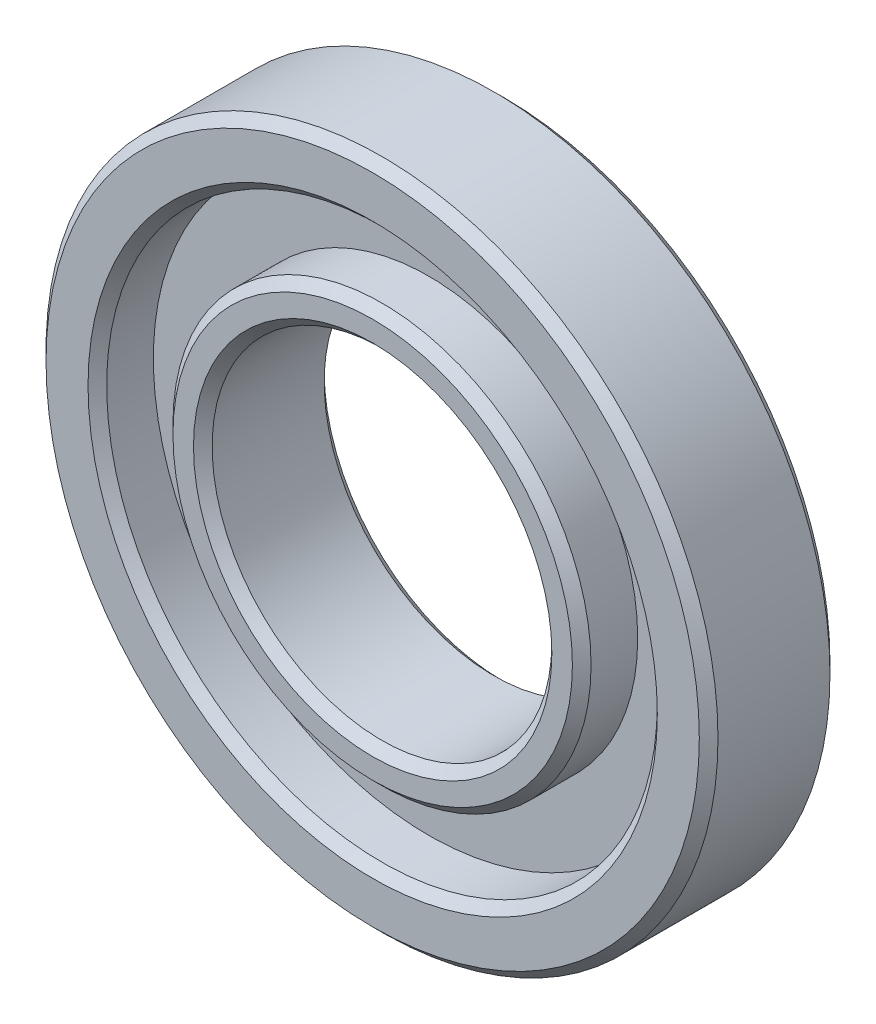
ISO-10303-21;
HEADER;
FILE_DESCRIPTION(('STEP AP214'),'2;1');
FILE_NAME('part.step','',(''),(''),'','','');
FILE_SCHEMA(('AUTOMOTIVE_DESIGN { 1 0 10303 214 1 1 1 1 }'));
ENDSEC;
DATA;
#1=APPLICATION_CONTEXT('core data for automotive mechanical design processes');
#2=APPLICATION_PROTOCOL_DEFINITION('international standard','automotive_design',2000,#1);
#3=PRODUCT_CONTEXT('',#1,'mechanical');
#4=PRODUCT('Part','Part','',(#3));
#5=PRODUCT_RELATED_PRODUCT_CATEGORY('part','',(#4));
#6=PRODUCT_DEFINITION_FORMATION('','',#4);
#7=PRODUCT_DEFINITION_CONTEXT('part definition',#1,'design');
#8=PRODUCT_DEFINITION('design','',#6,#7);
#9=PRODUCT_DEFINITION_SHAPE('','',#8);
#10=(LENGTH_UNIT() NAMED_UNIT(*) SI_UNIT(.MILLI.,.METRE.));
#11=(NAMED_UNIT(*) PLANE_ANGLE_UNIT() SI_UNIT($,.RADIAN.));
#12=(NAMED_UNIT(*) SI_UNIT($,.STERADIAN.) SOLID_ANGLE_UNIT());
#13=UNCERTAINTY_MEASURE_WITH_UNIT(LENGTH_MEASURE(1.E-05),#10,'distance_accuracy_value','');
#14=(GEOMETRIC_REPRESENTATION_CONTEXT(3) GLOBAL_UNCERTAINTY_ASSIGNED_CONTEXT((#13)) GLOBAL_UNIT_ASSIGNED_CONTEXT((#10,
#11,#12)) REPRESENTATION_CONTEXT('',''));
#15=CARTESIAN_POINT('',(0.,0.,0.));
#16=DIRECTION('',(0.,0.,1.));
#17=DIRECTION('',(1.,0.,0.));
#18=AXIS2_PLACEMENT_3D('',#15,#16,#17);
#19=CARTESIAN_POINT('',(0.,0.,7.));
#20=DIRECTION('',(0.,0.,1.));
#21=DIRECTION('',(1.,0.,0.));
#22=AXIS2_PLACEMENT_3D('',#19,#20,#21);
#23=PLANE('',#22);
#24=CARTESIAN_POINT('',(0.,0.,7.));
#25=DIRECTION('',(0.,0.,1.));
#26=DIRECTION('',(1.,0.,0.));
#27=AXIS2_PLACEMENT_3D('',#24,#25,#26);
#28=CIRCLE('',#27,9.59999999999999);
#29=CARTESIAN_POINT('',(9.59999999999999,0.,7.));
#30=VERTEX_POINT('',#29);
#31=EDGE_CURVE('E50',#30,#30,#28,.F.);
#32=ORIENTED_EDGE('',*,*,#31,.T.);
#33=EDGE_LOOP('',(#32));
#34=FACE_BOUND('',#33,.T.);
#35=CARTESIAN_POINT('',(0.,0.,7.));
#36=DIRECTION('',(0.,0.,1.));
#37=DIRECTION('',(1.,0.,0.));
#38=AXIS2_PLACEMENT_3D('',#35,#36,#37);
#39=CIRCLE('',#38,10.7);
#40=CARTESIAN_POINT('',(10.7,0.,7.));
#41=VERTEX_POINT('',#40);
#42=EDGE_CURVE('E53',#41,#41,#39,.T.);
#43=ORIENTED_EDGE('',*,*,#42,.T.);
#44=EDGE_LOOP('',(#43));
#45=FACE_BOUND('',#44,.T.);
#46=ADVANCED_FACE('F30',(#34,#45),#23,.T.);
#47=CARTESIAN_POINT('',(0.,0.,7.));
#48=DIRECTION('',(0.,0.,1.));
#49=DIRECTION('',(1.,0.,0.));
#50=AXIS2_PLACEMENT_3D('',#47,#48,#49);
#51=CIRCLE('',#50,15.25);
#52=CARTESIAN_POINT('',(15.25,0.,7.));
#53=VERTEX_POINT('',#52);
#54=EDGE_CURVE('E10',#53,#53,#51,.F.);
#55=ORIENTED_EDGE('',*,*,#54,.T.);
#56=EDGE_LOOP('',(#55));
#57=FACE_BOUND('',#56,.T.);
#58=CARTESIAN_POINT('',(0.,0.,7.));
#59=DIRECTION('',(0.,0.,1.));
#60=DIRECTION('',(1.,0.,0.));
#61=AXIS2_PLACEMENT_3D('',#58,#59,#60);
#62=CIRCLE('',#61,17.5);
#63=CARTESIAN_POINT('',(17.5,0.,7.));
#64=VERTEX_POINT('',#63);
#65=EDGE_CURVE('E37',#64,#64,#62,.T.);
#66=ORIENTED_EDGE('',*,*,#65,.T.);
#67=EDGE_LOOP('',(#66));
#68=FACE_BOUND('',#67,.T.);
#69=ADVANCED_FACE('F101',(#57,#68),#23,.T.);
#70=CARTESIAN_POINT('',(0.,0.,0.));
#71=DIRECTION('',(0.,0.,1.));
#72=DIRECTION('',(1.,0.,0.));
#73=AXIS2_PLACEMENT_3D('',#70,#71,#72);
#74=PLANE('',#73);
#75=CARTESIAN_POINT('',(0.,0.,0.));
#76=DIRECTION('',(0.,0.,1.));
#77=DIRECTION('',(1.,0.,0.));
#78=AXIS2_PLACEMENT_3D('',#75,#76,#77);
#79=CIRCLE('',#78,9.60000000000001);
#80=CARTESIAN_POINT('',(9.60000000000001,0.,0.));
#81=VERTEX_POINT('',#80);
#82=EDGE_CURVE('E68',#81,#81,#79,.T.);
#83=ORIENTED_EDGE('',*,*,#82,.T.);
#84=EDGE_LOOP('',(#83));
#85=FACE_BOUND('',#84,.T.);
#86=CARTESIAN_POINT('',(0.,0.,0.));
#87=DIRECTION('',(0.,0.,1.));
#88=DIRECTION('',(1.,0.,0.));
#89=AXIS2_PLACEMENT_3D('',#86,#87,#88);
#90=CIRCLE('',#89,17.5);
#91=CARTESIAN_POINT('',(17.5,0.,0.));
#92=VERTEX_POINT('',#91);
#93=EDGE_CURVE('E71',#92,#92,#90,.F.);
#94=ORIENTED_EDGE('',*,*,#93,.T.);
#95=EDGE_LOOP('',(#94));
#96=FACE_BOUND('',#95,.T.);
#97=ADVANCED_FACE('F107',(#85,#96),#74,.F.);
#98=CARTESIAN_POINT('',(0.,0.,7.));
#99=DIRECTION('',(0.,0.,-1.));
#100=DIRECTION('',(-1.,0.,0.));
#101=AXIS2_PLACEMENT_3D('',#98,#99,#100);
#102=CYLINDRICAL_SURFACE('',#101,18.);
#103=CARTESIAN_POINT('',(0.,0.,0.499999999999994));
#104=DIRECTION('',(0.,0.,1.));
#105=DIRECTION('',(1.,0.,0.));
#106=AXIS2_PLACEMENT_3D('',#103,#104,#105);
#107=CIRCLE('',#106,18.);
#108=CARTESIAN_POINT('',(18.,0.,0.499999999999994));
#109=VERTEX_POINT('',#108);
#110=EDGE_CURVE('E56',#109,#109,#107,.T.);
#111=ORIENTED_EDGE('',*,*,#110,.T.);
#112=EDGE_LOOP('',(#111));
#113=FACE_BOUND('',#112,.T.);
#114=CARTESIAN_POINT('',(0.,0.,6.5));
#115=DIRECTION('',(0.,0.,1.));
#116=DIRECTION('',(1.,0.,0.));
#117=AXIS2_PLACEMENT_3D('',#114,#115,#116);
#118=CIRCLE('',#117,18.);
#119=CARTESIAN_POINT('',(18.,0.,6.5));
#120=VERTEX_POINT('',#119);
#121=EDGE_CURVE('E59',#120,#120,#118,.F.);
#122=ORIENTED_EDGE('',*,*,#121,.T.);
#123=EDGE_LOOP('',(#122));
#124=FACE_BOUND('',#123,.T.);
#125=ADVANCED_FACE('F97',(#113,#124),#102,.T.);
#126=CARTESIAN_POINT('',(0.,0.,7.));
#127=DIRECTION('',(0.,0.,-1.));
#128=DIRECTION('',(-1.,0.,0.));
#129=AXIS2_PLACEMENT_3D('',#126,#127,#128);
#130=CYLINDRICAL_SURFACE('',#129,9.1);
#131=CARTESIAN_POINT('',(0.,0.,0.500000000000007));
#132=DIRECTION('',(0.,0.,1.));
#133=DIRECTION('',(1.,0.,0.));
#134=AXIS2_PLACEMENT_3D('',#131,#132,#133);
#135=CIRCLE('',#134,9.1);
#136=CARTESIAN_POINT('',(9.1,0.,0.500000000000007));
#137=VERTEX_POINT('',#136);
#138=EDGE_CURVE('E62',#137,#137,#135,.F.);
#139=ORIENTED_EDGE('',*,*,#138,.T.);
#140=EDGE_LOOP('',(#139));
#141=FACE_BOUND('',#140,.T.);
#142=CARTESIAN_POINT('',(0.,0.,6.50000000000001));
#143=DIRECTION('',(0.,0.,1.));
#144=DIRECTION('',(1.,0.,0.));
#145=AXIS2_PLACEMENT_3D('',#142,#143,#144);
#146=CIRCLE('',#145,9.1);
#147=CARTESIAN_POINT('',(9.1,0.,6.50000000000001));
#148=VERTEX_POINT('',#147);
#149=EDGE_CURVE('E65',#148,#148,#146,.T.);
#150=ORIENTED_EDGE('',*,*,#149,.T.);
#151=EDGE_LOOP('',(#150));
#152=FACE_BOUND('',#151,.T.);
#153=ADVANCED_FACE('F91',(#141,#152),#130,.F.);
#154=CARTESIAN_POINT('',(0.,0.,4.));
#155=DIRECTION('',(0.,0.,1.));
#156=DIRECTION('',(1.,0.,0.));
#157=AXIS2_PLACEMENT_3D('',#154,#155,#156);
#158=CYLINDRICAL_SURFACE('',#157,14.75);
#159=CARTESIAN_POINT('',(0.,0.,6.50000000000002));
#160=DIRECTION('',(0.,0.,1.));
#161=DIRECTION('',(1.,0.,0.));
#162=AXIS2_PLACEMENT_3D('',#159,#160,#161);
#163=CIRCLE('',#162,14.75);
#164=CARTESIAN_POINT('',(14.75,0.,6.50000000000002));
#165=VERTEX_POINT('',#164);
#166=EDGE_CURVE('E41',#165,#165,#163,.T.);
#167=ORIENTED_EDGE('',*,*,#166,.T.);
#168=EDGE_LOOP('',(#167));
#169=FACE_BOUND('',#168,.T.);
#170=CARTESIAN_POINT('',(0.,0.,4.));
#171=DIRECTION('',(0.,0.,1.));
#172=DIRECTION('',(1.,0.,0.));
#173=AXIS2_PLACEMENT_3D('',#170,#171,#172);
#174=CIRCLE('',#173,14.75);
#175=CARTESIAN_POINT('',(14.75,0.,4.));
#176=VERTEX_POINT('',#175);
#177=EDGE_CURVE('E74',#176,#176,#174,.T.);
#178=ORIENTED_EDGE('',*,*,#177,.F.);
#179=EDGE_LOOP('',(#178));
#180=FACE_BOUND('',#179,.T.);
#181=ADVANCED_FACE('F86',(#169,#180),#158,.F.);
#182=CARTESIAN_POINT('',(0.,0.,4.));
#183=DIRECTION('',(0.,0.,1.));
#184=DIRECTION('',(1.,0.,0.));
#185=AXIS2_PLACEMENT_3D('',#182,#183,#184);
#186=PLANE('',#185);
#187=CARTESIAN_POINT('',(0.,0.,4.));
#188=DIRECTION('',(0.,0.,1.));
#189=DIRECTION('',(1.,0.,0.));
#190=AXIS2_PLACEMENT_3D('',#187,#188,#189);
#191=CIRCLE('',#190,11.2);
#192=CARTESIAN_POINT('',(11.2,0.,4.));
#193=VERTEX_POINT('',#192);
#194=EDGE_CURVE('E77',#193,#193,#191,.T.);
#195=ORIENTED_EDGE('',*,*,#194,.F.);
#196=EDGE_LOOP('',(#195));
#197=FACE_BOUND('',#196,.T.);
#198=ORIENTED_EDGE('',*,*,#177,.T.);
#199=EDGE_LOOP('',(#198));
#200=FACE_BOUND('',#199,.T.);
#201=ADVANCED_FACE('F83',(#197,#200),#186,.T.);
#202=CARTESIAN_POINT('',(0.,0.,4.));
#203=DIRECTION('',(0.,0.,1.));
#204=DIRECTION('',(1.,0.,0.));
#205=AXIS2_PLACEMENT_3D('',#202,#203,#204);
#206=CYLINDRICAL_SURFACE('',#205,11.2);
#207=CARTESIAN_POINT('',(0.,0.,6.50000000000001));
#208=DIRECTION('',(0.,0.,1.));
#209=DIRECTION('',(1.,0.,0.));
#210=AXIS2_PLACEMENT_3D('',#207,#208,#209);
#211=CIRCLE('',#210,11.2);
#212=CARTESIAN_POINT('',(11.2,0.,6.50000000000001));
#213=VERTEX_POINT('',#212);
#214=EDGE_CURVE('E45',#213,#213,#211,.F.);
#215=ORIENTED_EDGE('',*,*,#214,.T.);
#216=EDGE_LOOP('',(#215));
#217=FACE_BOUND('',#216,.T.);
#218=ORIENTED_EDGE('',*,*,#194,.T.);
#219=EDGE_LOOP('',(#218));
#220=FACE_BOUND('',#219,.T.);
#221=ADVANCED_FACE('F81',(#217,#220),#206,.T.);
#222=CARTESIAN_POINT('',(0.,0.,0.));
#223=DIRECTION('',(0.,0.,-1.));
#224=DIRECTION('',(-1.,0.,0.));
#225=AXIS2_PLACEMENT_3D('',#222,#223,#224);
#226=CONICAL_SURFACE('',#225,9.60000000000001,0.785398163397452);
#227=ORIENTED_EDGE('',*,*,#138,.F.);
#228=EDGE_LOOP('',(#227));
#229=FACE_BOUND('',#228,.T.);
#230=ORIENTED_EDGE('',*,*,#82,.F.);
#231=EDGE_LOOP('',(#230));
#232=FACE_BOUND('',#231,.T.);
#233=ADVANCED_FACE('F116',(#229,#232),#226,.F.);
#234=CARTESIAN_POINT('',(0.,0.,0.499999999999994));
#235=DIRECTION('',(0.,0.,1.));
#236=DIRECTION('',(1.,0.,0.));
#237=AXIS2_PLACEMENT_3D('',#234,#235,#236);
#238=CONICAL_SURFACE('',#237,18.,0.785398163397452);
#239=ORIENTED_EDGE('',*,*,#93,.F.);
#240=EDGE_LOOP('',(#239));
#241=FACE_BOUND('',#240,.T.);
#242=ORIENTED_EDGE('',*,*,#110,.F.);
#243=EDGE_LOOP('',(#242));
#244=FACE_BOUND('',#243,.T.);
#245=ADVANCED_FACE('F119',(#241,#244),#238,.T.);
#246=CARTESIAN_POINT('',(0.,0.,6.50000000000001));
#247=DIRECTION('',(0.,0.,1.));
#248=DIRECTION('',(1.,0.,0.));
#249=AXIS2_PLACEMENT_3D('',#246,#247,#248);
#250=CONICAL_SURFACE('',#249,9.1,0.785398163397452);
#251=ORIENTED_EDGE('',*,*,#31,.F.);
#252=EDGE_LOOP('',(#251));
#253=FACE_BOUND('',#252,.T.);
#254=ORIENTED_EDGE('',*,*,#149,.F.);
#255=EDGE_LOOP('',(#254));
#256=FACE_BOUND('',#255,.T.);
#257=ADVANCED_FACE('F123',(#253,#256),#250,.F.);
#258=CARTESIAN_POINT('',(0.,0.,7.));
#259=DIRECTION('',(0.,0.,-1.));
#260=DIRECTION('',(-1.,0.,0.));
#261=AXIS2_PLACEMENT_3D('',#258,#259,#260);
#262=CONICAL_SURFACE('',#261,10.7,0.785398163397445);
#263=ORIENTED_EDGE('',*,*,#214,.F.);
#264=EDGE_LOOP('',(#263));
#265=FACE_BOUND('',#264,.T.);
#266=ORIENTED_EDGE('',*,*,#42,.F.);
#267=EDGE_LOOP('',(#266));
#268=FACE_BOUND('',#267,.T.);
#269=ADVANCED_FACE('F127',(#265,#268),#262,.T.);
#270=CARTESIAN_POINT('',(0.,0.,6.50000000000002));
#271=DIRECTION('',(0.,0.,1.));
#272=DIRECTION('',(1.,0.,0.));
#273=AXIS2_PLACEMENT_3D('',#270,#271,#272);
#274=CONICAL_SURFACE('',#273,14.75,0.78539816339745);
#275=ORIENTED_EDGE('',*,*,#54,.F.);
#276=EDGE_LOOP('',(#275));
#277=FACE_BOUND('',#276,.T.);
#278=ORIENTED_EDGE('',*,*,#166,.F.);
#279=EDGE_LOOP('',(#278));
#280=FACE_BOUND('',#279,.T.);
#281=ADVANCED_FACE('F130',(#277,#280),#274,.F.);
#282=CARTESIAN_POINT('',(0.,0.,7.));
#283=DIRECTION('',(0.,0.,-1.));
#284=DIRECTION('',(-1.,0.,0.));
#285=AXIS2_PLACEMENT_3D('',#282,#283,#284);
#286=CONICAL_SURFACE('',#285,17.5,0.785398163397441);
#287=ORIENTED_EDGE('',*,*,#121,.F.);
#288=EDGE_LOOP('',(#287));
#289=FACE_BOUND('',#288,.T.);
#290=ORIENTED_EDGE('',*,*,#65,.F.);
#291=EDGE_LOOP('',(#290));
#292=FACE_BOUND('',#291,.T.);
#293=ADVANCED_FACE('F32',(#289,#292),#286,.T.);
#294=CLOSED_SHELL('',(#46,#69,#97,#125,#153,#181,#201,#221,#233,#245,#257,#269,#281,#293));
#295=MANIFOLD_SOLID_BREP('B2',#294);
#296=ADVANCED_BREP_SHAPE_REPRESENTATION('',(#18,#295),#14);
#297=SHAPE_DEFINITION_REPRESENTATION(#9,#296);
ENDSEC;
END-ISO-10303-21;
